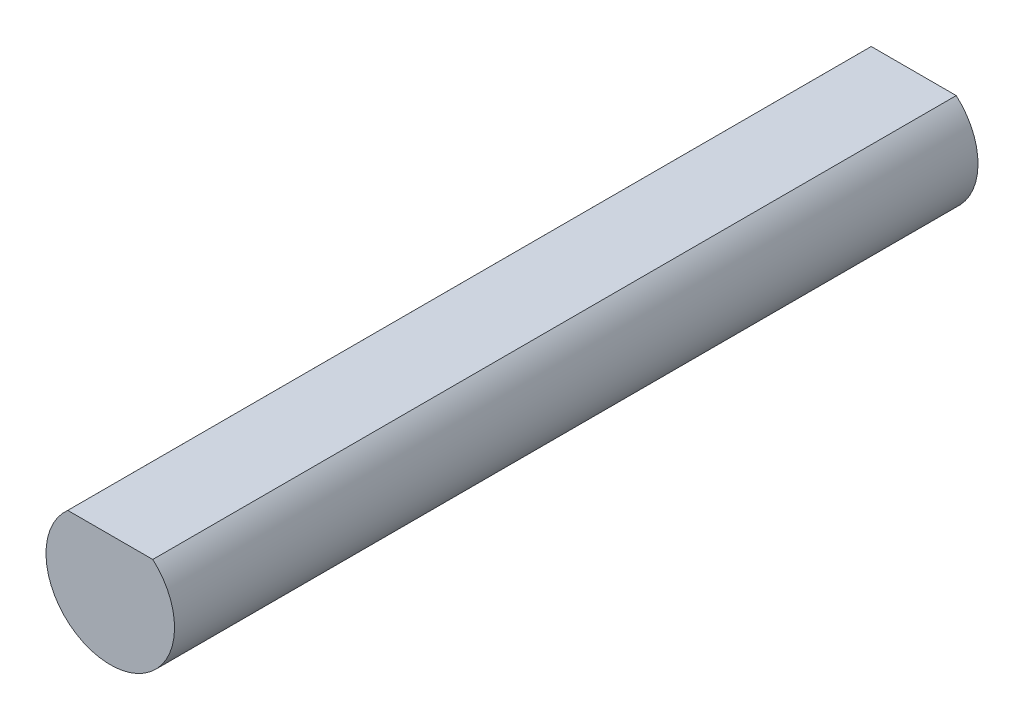
ISO-10303-21;
HEADER;
FILE_DESCRIPTION(('STEP AP214'),'2;1');
FILE_NAME('part.step','',(''),(''),'','','');
FILE_SCHEMA(('AUTOMOTIVE_DESIGN { 1 0 10303 214 1 1 1 1 }'));
ENDSEC;
DATA;
#1=APPLICATION_CONTEXT('core data for automotive mechanical design processes');
#2=APPLICATION_PROTOCOL_DEFINITION('international standard','automotive_design',2000,#1);
#3=PRODUCT_CONTEXT('',#1,'mechanical');
#4=PRODUCT('Part','Part','',(#3));
#5=PRODUCT_RELATED_PRODUCT_CATEGORY('part','',(#4));
#6=PRODUCT_DEFINITION_FORMATION('','',#4);
#7=PRODUCT_DEFINITION_CONTEXT('part definition',#1,'design');
#8=PRODUCT_DEFINITION('design','',#6,#7);
#9=PRODUCT_DEFINITION_SHAPE('','',#8);
#10=(LENGTH_UNIT() NAMED_UNIT(*) SI_UNIT(.MILLI.,.METRE.));
#11=(NAMED_UNIT(*) PLANE_ANGLE_UNIT() SI_UNIT($,.RADIAN.));
#12=(NAMED_UNIT(*) SI_UNIT($,.STERADIAN.) SOLID_ANGLE_UNIT());
#13=UNCERTAINTY_MEASURE_WITH_UNIT(LENGTH_MEASURE(1.E-05),#10,'distance_accuracy_value','');
#14=(GEOMETRIC_REPRESENTATION_CONTEXT(3) GLOBAL_UNCERTAINTY_ASSIGNED_CONTEXT((#13)) GLOBAL_UNIT_ASSIGNED_CONTEXT((#10,
#11,#12)) REPRESENTATION_CONTEXT('',''));
#15=CARTESIAN_POINT('',(0.,0.,0.));
#16=DIRECTION('',(0.,0.,1.));
#17=DIRECTION('',(1.,0.,0.));
#18=AXIS2_PLACEMENT_3D('',#15,#16,#17);
#19=CARTESIAN_POINT('',(0.,0.,25.));
#20=DIRECTION('',(0.,0.,-1.));
#21=DIRECTION('',(-1.,0.,0.));
#22=AXIS2_PLACEMENT_3D('',#19,#20,#21);
#23=CYLINDRICAL_SURFACE('',#22,2.);
#24=CARTESIAN_POINT('',(0.,0.,0.));
#25=DIRECTION('',(0.,0.,1.));
#26=DIRECTION('',(1.,0.,0.));
#27=AXIS2_PLACEMENT_3D('',#24,#25,#26);
#28=CIRCLE('',#27,2.);
#29=CARTESIAN_POINT('',(-1.3228756555323,1.5,0.));
#30=VERTEX_POINT('',#29);
#31=CARTESIAN_POINT('',(1.3228756555323,1.5,0.));
#32=VERTEX_POINT('',#31);
#33=EDGE_CURVE('E67',#30,#32,#28,.T.);
#34=ORIENTED_EDGE('',*,*,#33,.T.);
#35=DIRECTION('',(0.,0.,-1.));
#36=VECTOR('',#35,1.);
#37=CARTESIAN_POINT('',(1.3228756555323,1.5,25.));
#38=LINE('',#37,#36);
#39=CARTESIAN_POINT('',(1.3228756555323,1.5,25.));
#40=VERTEX_POINT('',#39);
#41=EDGE_CURVE('E11',#40,#32,#38,.T.);
#42=ORIENTED_EDGE('',*,*,#41,.F.);
#43=CARTESIAN_POINT('',(0.,0.,25.));
#44=DIRECTION('',(0.,0.,1.));
#45=DIRECTION('',(1.,0.,0.));
#46=AXIS2_PLACEMENT_3D('',#43,#44,#45);
#47=CIRCLE('',#46,2.);
#48=CARTESIAN_POINT('',(-1.3228756555323,1.5,25.));
#49=VERTEX_POINT('',#48);
#50=EDGE_CURVE('E66',#49,#40,#47,.T.);
#51=ORIENTED_EDGE('',*,*,#50,.F.);
#52=DIRECTION('',(0.,0.,-1.));
#53=VECTOR('',#52,1.);
#54=CARTESIAN_POINT('',(-1.3228756555323,1.5,25.));
#55=LINE('',#54,#53);
#56=EDGE_CURVE('E44',#49,#30,#55,.T.);
#57=ORIENTED_EDGE('',*,*,#56,.T.);
#58=EDGE_LOOP('',(#34,#42,#51,#57));
#59=FACE_BOUND('',#58,.T.);
#60=ADVANCED_FACE('F36',(#59),#23,.T.);
#61=CARTESIAN_POINT('',(-1.3228756555323,1.5,25.));
#62=DIRECTION('',(0.,-1.,0.));
#63=DIRECTION('',(0.,0.,-1.));
#64=AXIS2_PLACEMENT_3D('',#61,#62,#63);
#65=PLANE('',#64);
#66=DIRECTION('',(-1.,0.,0.));
#67=VECTOR('',#66,1.);
#68=CARTESIAN_POINT('',(-1.3228756555323,1.5,0.));
#69=LINE('',#68,#67);
#70=EDGE_CURVE('E59',#32,#30,#69,.T.);
#71=ORIENTED_EDGE('',*,*,#70,.T.);
#72=ORIENTED_EDGE('',*,*,#56,.F.);
#73=DIRECTION('',(-1.,0.,0.));
#74=VECTOR('',#73,1.);
#75=CARTESIAN_POINT('',(-1.3228756555323,1.5,25.));
#76=LINE('',#75,#74);
#77=EDGE_CURVE('E51',#40,#49,#76,.T.);
#78=ORIENTED_EDGE('',*,*,#77,.F.);
#79=ORIENTED_EDGE('',*,*,#41,.T.);
#80=EDGE_LOOP('',(#71,#72,#78,#79));
#81=FACE_BOUND('',#80,.T.);
#82=ADVANCED_FACE('F62',(#81),#65,.F.);
#83=CARTESIAN_POINT('',(0.,0.,25.));
#84=DIRECTION('',(0.,0.,1.));
#85=DIRECTION('',(1.,0.,0.));
#86=AXIS2_PLACEMENT_3D('',#83,#84,#85);
#87=PLANE('',#86);
#88=ORIENTED_EDGE('',*,*,#50,.T.);
#89=ORIENTED_EDGE('',*,*,#77,.T.);
#90=EDGE_LOOP('',(#88,#89));
#91=FACE_BOUND('',#90,.T.);
#92=ADVANCED_FACE('F74',(#91),#87,.T.);
#93=CARTESIAN_POINT('',(0.,0.,0.));
#94=DIRECTION('',(0.,0.,1.));
#95=DIRECTION('',(1.,0.,0.));
#96=AXIS2_PLACEMENT_3D('',#93,#94,#95);
#97=PLANE('',#96);
#98=ORIENTED_EDGE('',*,*,#33,.F.);
#99=ORIENTED_EDGE('',*,*,#70,.F.);
#100=EDGE_LOOP('',(#98,#99));
#101=FACE_BOUND('',#100,.T.);
#102=ADVANCED_FACE('F70',(#101),#97,.F.);
#103=CLOSED_SHELL('',(#60,#82,#92,#102));
#104=MANIFOLD_SOLID_BREP('B2',#103);
#105=ADVANCED_BREP_SHAPE_REPRESENTATION('',(#18,#104),#14);
#106=SHAPE_DEFINITION_REPRESENTATION(#9,#105);
ENDSEC;
END-ISO-10303-21;
